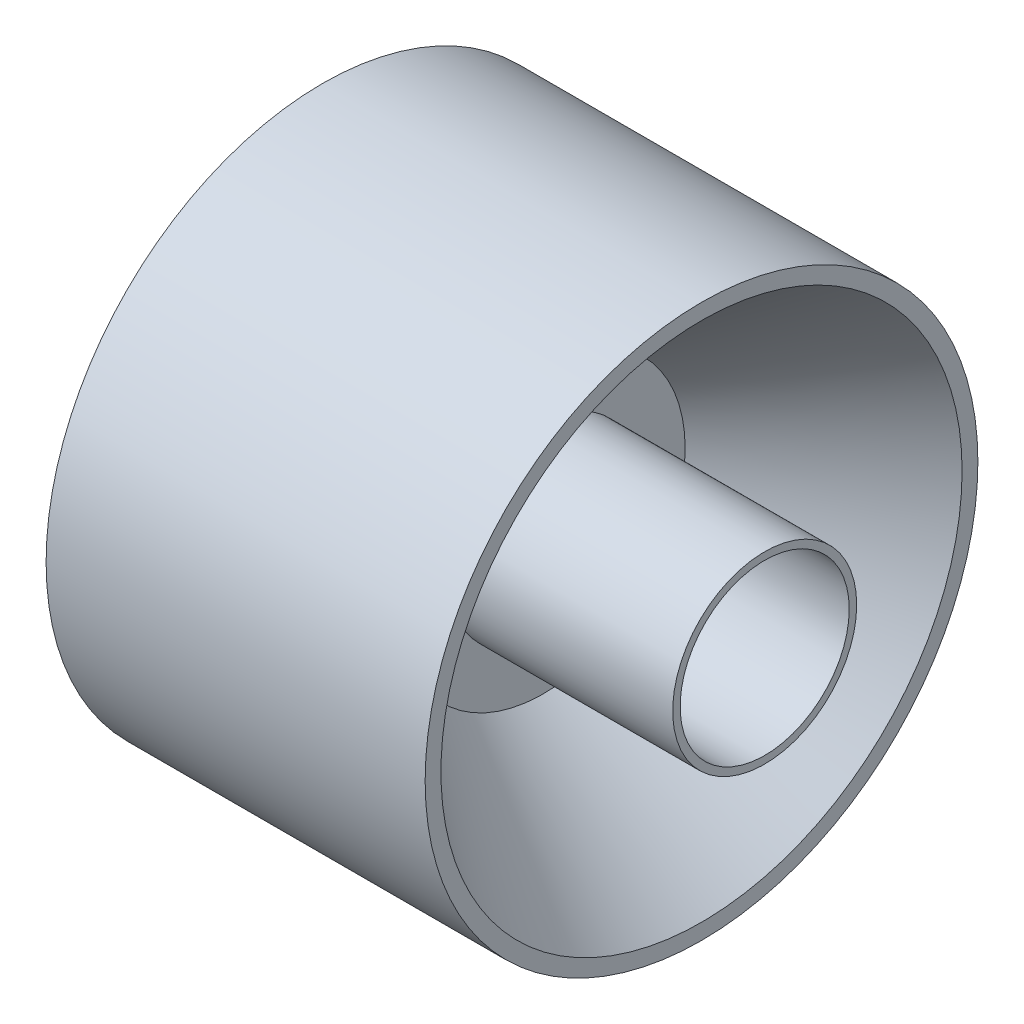
ISO-10303-21;
HEADER;
FILE_DESCRIPTION(('STEP AP214'),'2;1');
FILE_NAME('part.step','',(''),(''),'','','');
FILE_SCHEMA(('AUTOMOTIVE_DESIGN { 1 0 10303 214 1 1 1 1 }'));
ENDSEC;
DATA;
#1=APPLICATION_CONTEXT('core data for automotive mechanical design processes');
#2=APPLICATION_PROTOCOL_DEFINITION('international standard','automotive_design',2000,#1);
#3=PRODUCT_CONTEXT('',#1,'mechanical');
#4=PRODUCT('Part','Part','',(#3));
#5=PRODUCT_RELATED_PRODUCT_CATEGORY('part','',(#4));
#6=PRODUCT_DEFINITION_FORMATION('','',#4);
#7=PRODUCT_DEFINITION_CONTEXT('part definition',#1,'design');
#8=PRODUCT_DEFINITION('design','',#6,#7);
#9=PRODUCT_DEFINITION_SHAPE('','',#8);
#10=(LENGTH_UNIT() NAMED_UNIT(*) SI_UNIT(.MILLI.,.METRE.));
#11=(NAMED_UNIT(*) PLANE_ANGLE_UNIT() SI_UNIT($,.RADIAN.));
#12=(NAMED_UNIT(*) SI_UNIT($,.STERADIAN.) SOLID_ANGLE_UNIT());
#13=UNCERTAINTY_MEASURE_WITH_UNIT(LENGTH_MEASURE(1.E-05),#10,'distance_accuracy_value','');
#14=(GEOMETRIC_REPRESENTATION_CONTEXT(3) GLOBAL_UNCERTAINTY_ASSIGNED_CONTEXT((#13)) GLOBAL_UNIT_ASSIGNED_CONTEXT((#10,
#11,#12)) REPRESENTATION_CONTEXT('',''));
#15=CARTESIAN_POINT('',(0.,0.,0.));
#16=DIRECTION('',(0.,0.,1.));
#17=DIRECTION('',(1.,0.,0.));
#18=AXIS2_PLACEMENT_3D('',#15,#16,#17);
#19=CARTESIAN_POINT('',(76.2,0.,0.));
#20=DIRECTION('',(-1.,0.,0.));
#21=DIRECTION('',(0.,0.,1.));
#22=AXIS2_PLACEMENT_3D('',#19,#20,#21);
#23=CYLINDRICAL_SURFACE('',#22,55.5625);
#24=CARTESIAN_POINT('',(76.2,0.,0.));
#25=DIRECTION('',(1.,0.,0.));
#26=DIRECTION('',(0.,0.,-1.));
#27=AXIS2_PLACEMENT_3D('',#24,#25,#26);
#28=CIRCLE('',#27,55.5625);
#29=CARTESIAN_POINT('',(76.2,0.,-55.5625));
#30=VERTEX_POINT('',#29);
#31=EDGE_CURVE('E38',#30,#30,#28,.T.);
#32=ORIENTED_EDGE('',*,*,#31,.F.);
#33=EDGE_LOOP('',(#32));
#34=FACE_BOUND('',#33,.T.);
#35=CARTESIAN_POINT('',(0.,0.,0.));
#36=DIRECTION('',(1.,0.,0.));
#37=DIRECTION('',(0.,0.,-1.));
#38=AXIS2_PLACEMENT_3D('',#35,#36,#37);
#39=CIRCLE('',#38,55.5625);
#40=CARTESIAN_POINT('',(0.,0.,-55.5625));
#41=VERTEX_POINT('',#40);
#42=EDGE_CURVE('E42',#41,#41,#39,.T.);
#43=ORIENTED_EDGE('',*,*,#42,.T.);
#44=EDGE_LOOP('',(#43));
#45=FACE_BOUND('',#44,.T.);
#46=ADVANCED_FACE('F32',(#34,#45),#23,.T.);
#47=CARTESIAN_POINT('',(76.2,0.,0.));
#48=DIRECTION('',(1.,0.,0.));
#49=DIRECTION('',(0.,0.,-1.));
#50=AXIS2_PLACEMENT_3D('',#47,#48,#49);
#51=PLANE('',#50);
#52=CARTESIAN_POINT('',(76.2,0.,0.));
#53=DIRECTION('',(1.,0.,0.));
#54=DIRECTION('',(0.,0.,-1.));
#55=AXIS2_PLACEMENT_3D('',#52,#53,#54);
#56=CIRCLE('',#55,52.3875);
#57=CARTESIAN_POINT('',(76.2,0.,-52.3875));
#58=VERTEX_POINT('',#57);
#59=EDGE_CURVE('E51',#58,#58,#56,.T.);
#60=ORIENTED_EDGE('',*,*,#59,.F.);
#61=EDGE_LOOP('',(#60));
#62=FACE_BOUND('',#61,.T.);
#63=ORIENTED_EDGE('',*,*,#31,.T.);
#64=EDGE_LOOP('',(#63));
#65=FACE_BOUND('',#64,.T.);
#66=ADVANCED_FACE('F89',(#62,#65),#51,.T.);
#67=CARTESIAN_POINT('',(0.,0.,0.));
#68=DIRECTION('',(1.,0.,0.));
#69=DIRECTION('',(0.,0.,-1.));
#70=AXIS2_PLACEMENT_3D('',#67,#68,#69);
#71=PLANE('',#70);
#72=CARTESIAN_POINT('',(0.,0.,0.));
#73=DIRECTION('',(-1.,0.,0.));
#74=DIRECTION('',(0.,0.,1.));
#75=AXIS2_PLACEMENT_3D('',#72,#73,#74);
#76=CIRCLE('',#75,52.3875);
#77=CARTESIAN_POINT('',(0.,0.,52.3875));
#78=VERTEX_POINT('',#77);
#79=EDGE_CURVE('E57',#78,#78,#76,.T.);
#80=ORIENTED_EDGE('',*,*,#79,.F.);
#81=EDGE_LOOP('',(#80));
#82=FACE_BOUND('',#81,.T.);
#83=ORIENTED_EDGE('',*,*,#42,.F.);
#84=EDGE_LOOP('',(#83));
#85=FACE_BOUND('',#84,.T.);
#86=ADVANCED_FACE('F94',(#82,#85),#71,.F.);
#87=CARTESIAN_POINT('',(76.2,0.,0.));
#88=DIRECTION('',(1.,0.,0.));
#89=DIRECTION('',(0.,0.,-1.));
#90=AXIS2_PLACEMENT_3D('',#87,#88,#89);
#91=CONICAL_SURFACE('',#90,52.3875,0.645771823237902);
#92=CARTESIAN_POINT('',(44.45,0.,0.));
#93=DIRECTION('',(1.,0.,0.));
#94=DIRECTION('',(0.,0.,-1.));
#95=AXIS2_PLACEMENT_3D('',#92,#93,#94);
#96=CIRCLE('',#95,28.4621589092363);
#97=CARTESIAN_POINT('',(44.45,0.,-28.4621589092363));
#98=VERTEX_POINT('',#97);
#99=EDGE_CURVE('E47',#98,#98,#96,.T.);
#100=ORIENTED_EDGE('',*,*,#99,.F.);
#101=EDGE_LOOP('',(#100));
#102=FACE_BOUND('',#101,.T.);
#103=ORIENTED_EDGE('',*,*,#59,.T.);
#104=EDGE_LOOP('',(#103));
#105=FACE_BOUND('',#104,.T.);
#106=ADVANCED_FACE('F101',(#102,#105),#91,.F.);
#107=CARTESIAN_POINT('',(44.45,0.,0.));
#108=DIRECTION('',(1.,0.,0.));
#109=DIRECTION('',(0.,0.,-1.));
#110=AXIS2_PLACEMENT_3D('',#107,#108,#109);
#111=PLANE('',#110);
#112=CARTESIAN_POINT('',(44.45,0.,0.));
#113=DIRECTION('',(1.,0.,0.));
#114=DIRECTION('',(0.,0.,-1.));
#115=AXIS2_PLACEMENT_3D('',#112,#113,#114);
#116=CIRCLE('',#115,18.5);
#117=CARTESIAN_POINT('',(44.45,0.,-18.5));
#118=VERTEX_POINT('',#117);
#119=EDGE_CURVE('E61',#118,#118,#116,.T.);
#120=ORIENTED_EDGE('',*,*,#119,.F.);
#121=EDGE_LOOP('',(#120));
#122=FACE_BOUND('',#121,.T.);
#123=ORIENTED_EDGE('',*,*,#99,.T.);
#124=EDGE_LOOP('',(#123));
#125=FACE_BOUND('',#124,.T.);
#126=ADVANCED_FACE('F106',(#122,#125),#111,.T.);
#127=CARTESIAN_POINT('',(0.,0.,0.));
#128=DIRECTION('',(-1.,0.,0.));
#129=DIRECTION('',(0.,0.,1.));
#130=AXIS2_PLACEMENT_3D('',#127,#128,#129);
#131=CONICAL_SURFACE('',#130,52.3875,0.645771823237902);
#132=CARTESIAN_POINT('',(31.75,0.,0.));
#133=DIRECTION('',(-1.,0.,0.));
#134=DIRECTION('',(0.,0.,1.));
#135=AXIS2_PLACEMENT_3D('',#132,#133,#134);
#136=CIRCLE('',#135,28.4621589092363);
#137=CARTESIAN_POINT('',(31.75,0.,28.4621589092363));
#138=VERTEX_POINT('',#137);
#139=EDGE_CURVE('E54',#138,#138,#136,.T.);
#140=ORIENTED_EDGE('',*,*,#139,.F.);
#141=EDGE_LOOP('',(#140));
#142=FACE_BOUND('',#141,.T.);
#143=ORIENTED_EDGE('',*,*,#79,.T.);
#144=EDGE_LOOP('',(#143));
#145=FACE_BOUND('',#144,.T.);
#146=ADVANCED_FACE('F84',(#142,#145),#131,.F.);
#147=CARTESIAN_POINT('',(31.75,0.,0.));
#148=DIRECTION('',(-1.,0.,0.));
#149=DIRECTION('',(0.,0.,1.));
#150=AXIS2_PLACEMENT_3D('',#147,#148,#149);
#151=PLANE('',#150);
#152=ORIENTED_EDGE('',*,*,#139,.T.);
#153=EDGE_LOOP('',(#152));
#154=FACE_BOUND('',#153,.T.);
#155=ADVANCED_FACE('F75',(#154),#151,.T.);
#156=CARTESIAN_POINT('',(88.9,0.,0.));
#157=DIRECTION('',(1.,0.,0.));
#158=DIRECTION('',(0.,0.,-1.));
#159=AXIS2_PLACEMENT_3D('',#156,#157,#158);
#160=PLANE('',#159);
#161=CARTESIAN_POINT('',(88.9,0.,0.));
#162=DIRECTION('',(1.,0.,0.));
#163=DIRECTION('',(0.,0.,-1.));
#164=AXIS2_PLACEMENT_3D('',#161,#162,#163);
#165=CIRCLE('',#164,18.5);
#166=CARTESIAN_POINT('',(88.9,0.,-18.5));
#167=VERTEX_POINT('',#166);
#168=EDGE_CURVE('E60',#167,#167,#165,.T.);
#169=ORIENTED_EDGE('',*,*,#168,.T.);
#170=EDGE_LOOP('',(#169));
#171=FACE_BOUND('',#170,.T.);
#172=CARTESIAN_POINT('',(88.9,0.,0.));
#173=DIRECTION('',(1.,0.,0.));
#174=DIRECTION('',(0.,0.,-1.));
#175=AXIS2_PLACEMENT_3D('',#172,#173,#174);
#176=CIRCLE('',#175,17.);
#177=CARTESIAN_POINT('',(88.9,0.,-17.));
#178=VERTEX_POINT('',#177);
#179=EDGE_CURVE('E64',#178,#178,#176,.T.);
#180=ORIENTED_EDGE('',*,*,#179,.F.);
#181=EDGE_LOOP('',(#180));
#182=FACE_BOUND('',#181,.T.);
#183=ADVANCED_FACE('F72',(#171,#182),#160,.T.);
#184=CARTESIAN_POINT('',(88.9,0.,0.));
#185=DIRECTION('',(-1.,0.,0.));
#186=DIRECTION('',(0.,0.,1.));
#187=AXIS2_PLACEMENT_3D('',#184,#185,#186);
#188=CYLINDRICAL_SURFACE('',#187,18.5);
#189=ORIENTED_EDGE('',*,*,#168,.F.);
#190=EDGE_LOOP('',(#189));
#191=FACE_BOUND('',#190,.T.);
#192=ORIENTED_EDGE('',*,*,#119,.T.);
#193=EDGE_LOOP('',(#192));
#194=FACE_BOUND('',#193,.T.);
#195=ADVANCED_FACE('F74',(#191,#194),#188,.T.);
#196=CARTESIAN_POINT('',(88.9,0.,0.));
#197=DIRECTION('',(-1.,0.,0.));
#198=DIRECTION('',(0.,0.,1.));
#199=AXIS2_PLACEMENT_3D('',#196,#197,#198);
#200=CYLINDRICAL_SURFACE('',#199,17.);
#201=ORIENTED_EDGE('',*,*,#179,.T.);
#202=EDGE_LOOP('',(#201));
#203=FACE_BOUND('',#202,.T.);
#204=CARTESIAN_POINT('',(44.45,0.,0.));
#205=DIRECTION('',(1.,0.,0.));
#206=DIRECTION('',(0.,0.,-1.));
#207=AXIS2_PLACEMENT_3D('',#204,#205,#206);
#208=CIRCLE('',#207,17.);
#209=CARTESIAN_POINT('',(44.45,0.,-17.));
#210=VERTEX_POINT('',#209);
#211=EDGE_CURVE('E10',#210,#210,#208,.F.);
#212=ORIENTED_EDGE('',*,*,#211,.T.);
#213=EDGE_LOOP('',(#212));
#214=FACE_BOUND('',#213,.T.);
#215=ADVANCED_FACE('F70',(#203,#214),#200,.F.);
#216=ORIENTED_EDGE('',*,*,#211,.F.);
#217=EDGE_LOOP('',(#216));
#218=FACE_BOUND('',#217,.T.);
#219=ADVANCED_FACE('F114',(#218),#111,.T.);
#220=CLOSED_SHELL('',(#46,#66,#86,#106,#126,#146,#155,#183,#195,#215,#219));
#221=MANIFOLD_SOLID_BREP('B2',#220);
#222=ADVANCED_BREP_SHAPE_REPRESENTATION('',(#18,#221),#14);
#223=SHAPE_DEFINITION_REPRESENTATION(#9,#222);
ENDSEC;
END-ISO-10303-21;
